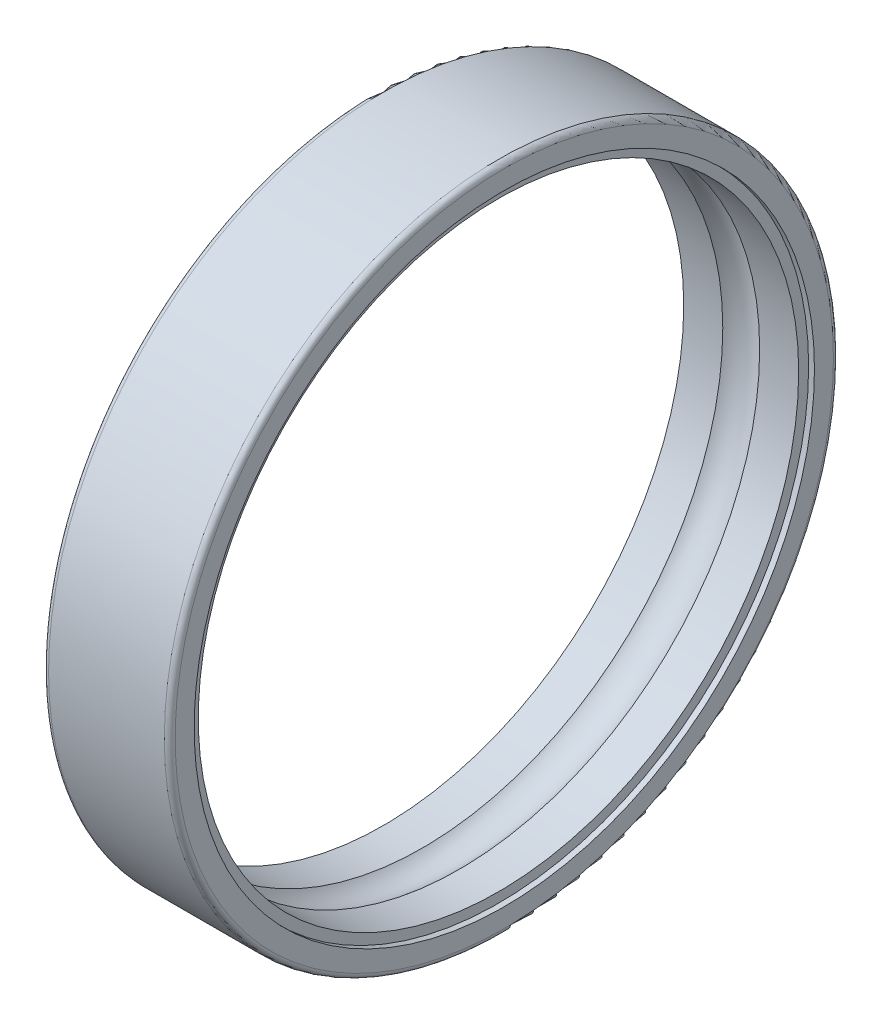
ISO-10303-21;
HEADER;
FILE_DESCRIPTION(('STEP AP214'),'2;1');
FILE_NAME('part.step','',(''),(''),'','','');
FILE_SCHEMA(('AUTOMOTIVE_DESIGN { 1 0 10303 214 1 1 1 1 }'));
ENDSEC;
DATA;
#1=APPLICATION_CONTEXT('core data for automotive mechanical design processes');
#2=APPLICATION_PROTOCOL_DEFINITION('international standard','automotive_design',2000,#1);
#3=PRODUCT_CONTEXT('',#1,'mechanical');
#4=PRODUCT('Part','Part','',(#3));
#5=PRODUCT_RELATED_PRODUCT_CATEGORY('part','',(#4));
#6=PRODUCT_DEFINITION_FORMATION('','',#4);
#7=PRODUCT_DEFINITION_CONTEXT('part definition',#1,'design');
#8=PRODUCT_DEFINITION('design','',#6,#7);
#9=PRODUCT_DEFINITION_SHAPE('','',#8);
#10=(LENGTH_UNIT() NAMED_UNIT(*) SI_UNIT(.MILLI.,.METRE.));
#11=(NAMED_UNIT(*) PLANE_ANGLE_UNIT() SI_UNIT($,.RADIAN.));
#12=(NAMED_UNIT(*) SI_UNIT($,.STERADIAN.) SOLID_ANGLE_UNIT());
#13=UNCERTAINTY_MEASURE_WITH_UNIT(LENGTH_MEASURE(1.E-05),#10,'distance_accuracy_value','');
#14=(GEOMETRIC_REPRESENTATION_CONTEXT(3) GLOBAL_UNCERTAINTY_ASSIGNED_CONTEXT((#13)) GLOBAL_UNIT_ASSIGNED_CONTEXT((#10,
#11,#12)) REPRESENTATION_CONTEXT('',''));
#15=CARTESIAN_POINT('',(0.,0.,0.));
#16=DIRECTION('',(0.,0.,1.));
#17=DIRECTION('',(1.,0.,0.));
#18=AXIS2_PLACEMENT_3D('',#15,#16,#17);
#19=CARTESIAN_POINT('',(0.3,0.,0.));
#20=DIRECTION('',(1.,0.,0.));
#21=DIRECTION('',(0.,0.,-1.));
#22=AXIS2_PLACEMENT_3D('',#19,#20,#21);
#23=TOROIDAL_SURFACE('',#22,18.2,0.3);
#24=CARTESIAN_POINT('',(0.3,0.,0.));
#25=DIRECTION('',(1.,0.,0.));
#26=DIRECTION('',(0.,0.,-1.));
#27=AXIS2_PLACEMENT_3D('',#24,#25,#26);
#28=CIRCLE('',#27,18.5);
#29=CARTESIAN_POINT('',(0.3,0.,-18.5));
#30=VERTEX_POINT('',#29);
#31=EDGE_CURVE('E11',#30,#30,#28,.T.);
#32=ORIENTED_EDGE('',*,*,#31,.F.);
#33=EDGE_LOOP('',(#32));
#34=FACE_BOUND('',#33,.T.);
#35=CARTESIAN_POINT('',(0.,0.,0.));
#36=DIRECTION('',(1.,0.,0.));
#37=DIRECTION('',(0.,0.,-1.));
#38=AXIS2_PLACEMENT_3D('',#35,#36,#37);
#39=CIRCLE('',#38,18.2);
#40=CARTESIAN_POINT('',(0.,0.,-18.2));
#41=VERTEX_POINT('',#40);
#42=EDGE_CURVE('E20',#41,#41,#39,.T.);
#43=ORIENTED_EDGE('',*,*,#42,.T.);
#44=EDGE_LOOP('',(#43));
#45=FACE_BOUND('',#44,.T.);
#46=ADVANCED_FACE('F16',(#34,#45),#23,.T.);
#47=CARTESIAN_POINT('',(7.,0.,0.));
#48=DIRECTION('',(1.,0.,0.));
#49=DIRECTION('',(0.,0.,-1.));
#50=AXIS2_PLACEMENT_3D('',#47,#48,#49);
#51=CYLINDRICAL_SURFACE('',#50,18.5);
#52=CARTESIAN_POINT('',(6.7,0.,0.));
#53=DIRECTION('',(1.,0.,0.));
#54=DIRECTION('',(0.,0.,-1.));
#55=AXIS2_PLACEMENT_3D('',#52,#53,#54);
#56=CIRCLE('',#55,18.5);
#57=CARTESIAN_POINT('',(6.7,0.,-18.5));
#58=VERTEX_POINT('',#57);
#59=EDGE_CURVE('E27',#58,#58,#56,.T.);
#60=ORIENTED_EDGE('',*,*,#59,.F.);
#61=EDGE_LOOP('',(#60));
#62=FACE_BOUND('',#61,.T.);
#63=ORIENTED_EDGE('',*,*,#31,.T.);
#64=EDGE_LOOP('',(#63));
#65=FACE_BOUND('',#64,.T.);
#66=ADVANCED_FACE('F144',(#62,#65),#51,.T.);
#67=CARTESIAN_POINT('',(6.7,0.,0.));
#68=DIRECTION('',(1.,0.,0.));
#69=DIRECTION('',(0.,0.,-1.));
#70=AXIS2_PLACEMENT_3D('',#67,#68,#69);
#71=TOROIDAL_SURFACE('',#70,18.2,0.299999999999993);
#72=CARTESIAN_POINT('',(7.,0.,0.));
#73=DIRECTION('',(1.,0.,0.));
#74=DIRECTION('',(0.,0.,-1.));
#75=AXIS2_PLACEMENT_3D('',#72,#73,#74);
#76=CIRCLE('',#75,18.2);
#77=CARTESIAN_POINT('',(7.,0.,-18.2));
#78=VERTEX_POINT('',#77);
#79=EDGE_CURVE('E99',#78,#78,#76,.T.);
#80=ORIENTED_EDGE('',*,*,#79,.F.);
#81=EDGE_LOOP('',(#80));
#82=FACE_BOUND('',#81,.T.);
#83=ORIENTED_EDGE('',*,*,#59,.T.);
#84=EDGE_LOOP('',(#83));
#85=FACE_BOUND('',#84,.T.);
#86=ADVANCED_FACE('F138',(#82,#85),#71,.T.);
#87=CARTESIAN_POINT('',(7.,17.15,0.));
#88=DIRECTION('',(1.,0.,0.));
#89=DIRECTION('',(0.,1.,0.));
#90=AXIS2_PLACEMENT_3D('',#87,#88,#89);
#91=PLANE('',#90);
#92=CARTESIAN_POINT('',(7.,0.,0.));
#93=DIRECTION('',(1.,0.,0.));
#94=DIRECTION('',(0.,0.,-1.));
#95=AXIS2_PLACEMENT_3D('',#92,#93,#94);
#96=CIRCLE('',#95,17.15);
#97=CARTESIAN_POINT('',(7.,0.,-17.15));
#98=VERTEX_POINT('',#97);
#99=EDGE_CURVE('E96',#98,#98,#96,.T.);
#100=ORIENTED_EDGE('',*,*,#99,.F.);
#101=EDGE_LOOP('',(#100));
#102=FACE_BOUND('',#101,.T.);
#103=ORIENTED_EDGE('',*,*,#79,.T.);
#104=EDGE_LOOP('',(#103));
#105=FACE_BOUND('',#104,.T.);
#106=ADVANCED_FACE('F133',(#102,#105),#91,.T.);
#107=CARTESIAN_POINT('',(7.,0.,0.));
#108=DIRECTION('',(1.,0.,0.));
#109=DIRECTION('',(0.,0.,-1.));
#110=AXIS2_PLACEMENT_3D('',#107,#108,#109);
#111=CYLINDRICAL_SURFACE('',#110,17.15);
#112=CARTESIAN_POINT('',(6.678,0.,0.));
#113=DIRECTION('',(1.,0.,0.));
#114=DIRECTION('',(0.,0.,-1.));
#115=AXIS2_PLACEMENT_3D('',#112,#113,#114);
#116=CIRCLE('',#115,17.15);
#117=CARTESIAN_POINT('',(6.678,0.,-17.15));
#118=VERTEX_POINT('',#117);
#119=EDGE_CURVE('E100',#118,#118,#116,.T.);
#120=ORIENTED_EDGE('',*,*,#119,.F.);
#121=EDGE_LOOP('',(#120));
#122=FACE_BOUND('',#121,.T.);
#123=ORIENTED_EDGE('',*,*,#99,.T.);
#124=EDGE_LOOP('',(#123));
#125=FACE_BOUND('',#124,.T.);
#126=ADVANCED_FACE('F130',(#122,#125),#111,.F.);
#127=CARTESIAN_POINT('',(6.678,16.6,0.));
#128=DIRECTION('',(1.,0.,0.));
#129=DIRECTION('',(0.,1.,0.));
#130=AXIS2_PLACEMENT_3D('',#127,#128,#129);
#131=PLANE('',#130);
#132=CARTESIAN_POINT('',(6.678,0.,0.));
#133=DIRECTION('',(1.,0.,0.));
#134=DIRECTION('',(0.,0.,-1.));
#135=AXIS2_PLACEMENT_3D('',#132,#133,#134);
#136=CIRCLE('',#135,16.6);
#137=CARTESIAN_POINT('',(6.678,0.,-16.6));
#138=VERTEX_POINT('',#137);
#139=EDGE_CURVE('E104',#138,#138,#136,.T.);
#140=ORIENTED_EDGE('',*,*,#139,.F.);
#141=EDGE_LOOP('',(#140));
#142=FACE_BOUND('',#141,.T.);
#143=ORIENTED_EDGE('',*,*,#119,.T.);
#144=EDGE_LOOP('',(#143));
#145=FACE_BOUND('',#144,.T.);
#146=ADVANCED_FACE('F128',(#142,#145),#131,.T.);
#147=CARTESIAN_POINT('',(7.,0.,0.));
#148=DIRECTION('',(1.,0.,0.));
#149=DIRECTION('',(0.,0.,-1.));
#150=AXIS2_PLACEMENT_3D('',#147,#148,#149);
#151=CYLINDRICAL_SURFACE('',#150,16.6);
#152=CARTESIAN_POINT('',(4.51980390271856,0.,0.));
#153=DIRECTION('',(1.,0.,0.));
#154=DIRECTION('',(0.,0.,-1.));
#155=AXIS2_PLACEMENT_3D('',#152,#153,#154);
#156=CIRCLE('',#155,16.6);
#157=CARTESIAN_POINT('',(4.51980390271856,0.,-16.6));
#158=VERTEX_POINT('',#157);
#159=EDGE_CURVE('E101',#158,#158,#156,.T.);
#160=ORIENTED_EDGE('',*,*,#159,.F.);
#161=EDGE_LOOP('',(#160));
#162=FACE_BOUND('',#161,.T.);
#163=ORIENTED_EDGE('',*,*,#139,.T.);
#164=EDGE_LOOP('',(#163));
#165=FACE_BOUND('',#164,.T.);
#166=ADVANCED_FACE('F173',(#162,#165),#151,.F.);
#167=CARTESIAN_POINT('',(3.5,0.,0.));
#168=DIRECTION('',(1.,0.,0.));
#169=DIRECTION('',(0.,0.,-1.));
#170=AXIS2_PLACEMENT_3D('',#167,#168,#169);
#171=TOROIDAL_SURFACE('',#170,15.5,1.5);
#172=ORIENTED_EDGE('',*,*,#159,.T.);
#173=EDGE_LOOP('',(#172));
#174=FACE_BOUND('',#173,.T.);
#175=CARTESIAN_POINT('',(2.48019609728144,0.,0.));
#176=DIRECTION('',(1.,0.,0.));
#177=DIRECTION('',(0.,0.,-1.));
#178=AXIS2_PLACEMENT_3D('',#175,#176,#177);
#179=CIRCLE('',#178,16.6);
#180=CARTESIAN_POINT('',(2.48019609728144,0.,-16.6));
#181=VERTEX_POINT('',#180);
#182=EDGE_CURVE('E105',#181,#181,#179,.T.);
#183=ORIENTED_EDGE('',*,*,#182,.F.);
#184=EDGE_LOOP('',(#183));
#185=FACE_BOUND('',#184,.T.);
#186=ADVANCED_FACE('F18',(#174,#185),#171,.F.);
#187=CARTESIAN_POINT('',(7.,0.,0.));
#188=DIRECTION('',(1.,0.,0.));
#189=DIRECTION('',(0.,0.,-1.));
#190=AXIS2_PLACEMENT_3D('',#187,#188,#189);
#191=CYLINDRICAL_SURFACE('',#190,16.6);
#192=CARTESIAN_POINT('',(0.322,0.,0.));
#193=DIRECTION('',(1.,0.,0.));
#194=DIRECTION('',(0.,0.,-1.));
#195=AXIS2_PLACEMENT_3D('',#192,#193,#194);
#196=CIRCLE('',#195,16.6);
#197=CARTESIAN_POINT('',(0.322,0.,-16.6));
#198=VERTEX_POINT('',#197);
#199=EDGE_CURVE('E88',#198,#198,#196,.T.);
#200=ORIENTED_EDGE('',*,*,#199,.F.);
#201=EDGE_LOOP('',(#200));
#202=FACE_BOUND('',#201,.T.);
#203=ORIENTED_EDGE('',*,*,#182,.T.);
#204=EDGE_LOOP('',(#203));
#205=FACE_BOUND('',#204,.T.);
#206=ADVANCED_FACE('F169',(#202,#205),#191,.F.);
#207=CARTESIAN_POINT('',(0.322,17.15,0.));
#208=DIRECTION('',(-1.,0.,0.));
#209=DIRECTION('',(0.,0.,1.));
#210=AXIS2_PLACEMENT_3D('',#207,#208,#209);
#211=PLANE('',#210);
#212=CARTESIAN_POINT('',(0.322,0.,0.));
#213=DIRECTION('',(1.,0.,0.));
#214=DIRECTION('',(0.,0.,-1.));
#215=AXIS2_PLACEMENT_3D('',#212,#213,#214);
#216=CIRCLE('',#215,17.15);
#217=CARTESIAN_POINT('',(0.322,0.,-17.15));
#218=VERTEX_POINT('',#217);
#219=EDGE_CURVE('E82',#218,#218,#216,.T.);
#220=ORIENTED_EDGE('',*,*,#219,.F.);
#221=EDGE_LOOP('',(#220));
#222=FACE_BOUND('',#221,.T.);
#223=ORIENTED_EDGE('',*,*,#199,.T.);
#224=EDGE_LOOP('',(#223));
#225=FACE_BOUND('',#224,.T.);
#226=ADVANCED_FACE('F163',(#222,#225),#211,.T.);
#227=CARTESIAN_POINT('',(7.,0.,0.));
#228=DIRECTION('',(1.,0.,0.));
#229=DIRECTION('',(0.,0.,-1.));
#230=AXIS2_PLACEMENT_3D('',#227,#228,#229);
#231=CYLINDRICAL_SURFACE('',#230,17.15);
#232=CARTESIAN_POINT('',(0.,0.,0.));
#233=DIRECTION('',(1.,0.,0.));
#234=DIRECTION('',(0.,0.,-1.));
#235=AXIS2_PLACEMENT_3D('',#232,#233,#234);
#236=CIRCLE('',#235,17.15);
#237=CARTESIAN_POINT('',(0.,0.,-17.15));
#238=VERTEX_POINT('',#237);
#239=EDGE_CURVE('E74',#238,#238,#236,.T.);
#240=ORIENTED_EDGE('',*,*,#239,.F.);
#241=EDGE_LOOP('',(#240));
#242=FACE_BOUND('',#241,.T.);
#243=ORIENTED_EDGE('',*,*,#219,.T.);
#244=EDGE_LOOP('',(#243));
#245=FACE_BOUND('',#244,.T.);
#246=ADVANCED_FACE('F159',(#242,#245),#231,.F.);
#247=CARTESIAN_POINT('',(0.,18.2,0.));
#248=DIRECTION('',(-1.,0.,0.));
#249=DIRECTION('',(0.,0.,1.));
#250=AXIS2_PLACEMENT_3D('',#247,#248,#249);
#251=PLANE('',#250);
#252=ORIENTED_EDGE('',*,*,#42,.F.);
#253=EDGE_LOOP('',(#252));
#254=FACE_BOUND('',#253,.T.);
#255=ORIENTED_EDGE('',*,*,#239,.T.);
#256=EDGE_LOOP('',(#255));
#257=FACE_BOUND('',#256,.T.);
#258=ADVANCED_FACE('F157',(#254,#257),#251,.T.);
#259=CLOSED_SHELL('',(#46,#66,#86,#106,#126,#146,#166,#186,#206,#226,#246,#258));
#260=MANIFOLD_SOLID_BREP('B1',#259);
#261=ADVANCED_BREP_SHAPE_REPRESENTATION('',(#18,#260),#14);
#262=SHAPE_DEFINITION_REPRESENTATION(#9,#261);
ENDSEC;
END-ISO-10303-21;
